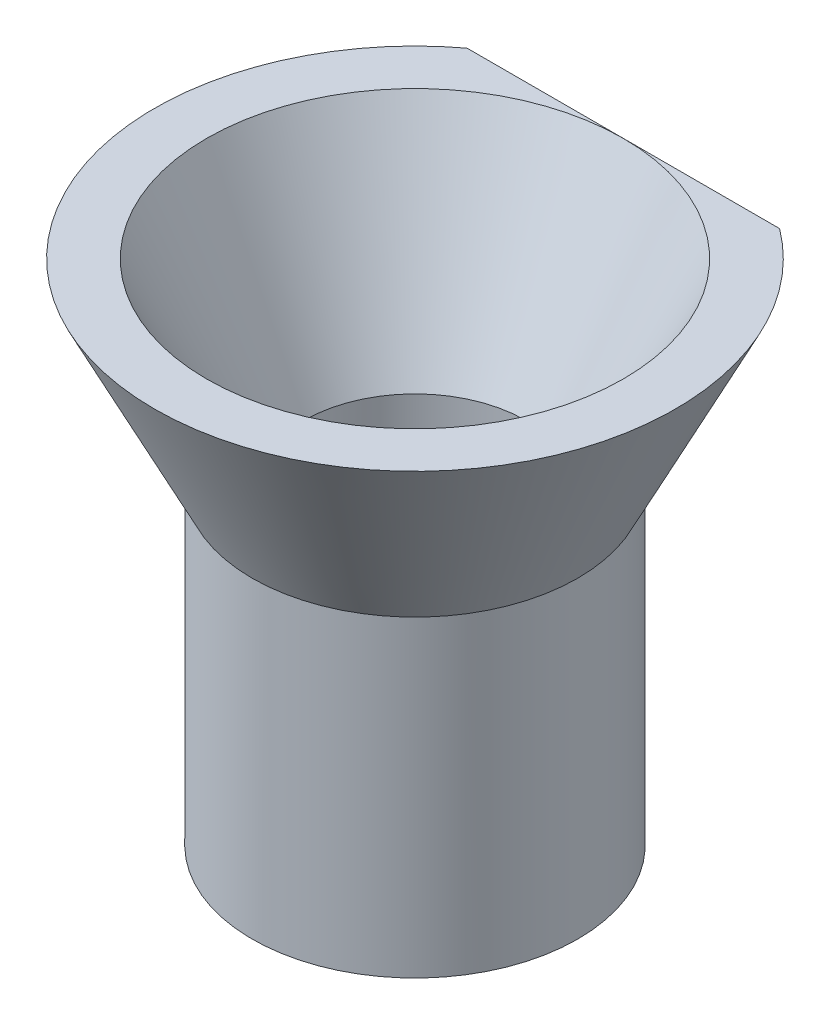
ISO-10303-21;
HEADER;
FILE_DESCRIPTION(('STEP AP214'),'2;1');
FILE_NAME('part.step','',(''),(''),'','','');
FILE_SCHEMA(('AUTOMOTIVE_DESIGN { 1 0 10303 214 1 1 1 1 }'));
ENDSEC;
DATA;
#1=APPLICATION_CONTEXT('core data for automotive mechanical design processes');
#2=APPLICATION_PROTOCOL_DEFINITION('international standard','automotive_design',2000,#1);
#3=PRODUCT_CONTEXT('',#1,'mechanical');
#4=PRODUCT('Part','Part','',(#3));
#5=PRODUCT_RELATED_PRODUCT_CATEGORY('part','',(#4));
#6=PRODUCT_DEFINITION_FORMATION('','',#4);
#7=PRODUCT_DEFINITION_CONTEXT('part definition',#1,'design');
#8=PRODUCT_DEFINITION('design','',#6,#7);
#9=PRODUCT_DEFINITION_SHAPE('','',#8);
#10=(LENGTH_UNIT() NAMED_UNIT(*) SI_UNIT(.MILLI.,.METRE.));
#11=(NAMED_UNIT(*) PLANE_ANGLE_UNIT() SI_UNIT($,.RADIAN.));
#12=(NAMED_UNIT(*) SI_UNIT($,.STERADIAN.) SOLID_ANGLE_UNIT());
#13=UNCERTAINTY_MEASURE_WITH_UNIT(LENGTH_MEASURE(1.E-05),#10,'distance_accuracy_value','');
#14=(GEOMETRIC_REPRESENTATION_CONTEXT(3) GLOBAL_UNCERTAINTY_ASSIGNED_CONTEXT((#13)) GLOBAL_UNIT_ASSIGNED_CONTEXT((#10,
#11,#12)) REPRESENTATION_CONTEXT('',''));
#15=CARTESIAN_POINT('',(0.,0.,0.));
#16=DIRECTION('',(0.,0.,1.));
#17=DIRECTION('',(1.,0.,0.));
#18=AXIS2_PLACEMENT_3D('',#15,#16,#17);
#19=CARTESIAN_POINT('',(0.,7.5,0.));
#20=DIRECTION('',(0.,1.,0.));
#21=DIRECTION('',(-1.,0.,0.));
#22=AXIS2_PLACEMENT_3D('',#19,#20,#21);
#23=CONICAL_SURFACE('',#22,10.,0.463647609000806);
#24=CARTESIAN_POINT('',(-13.16236811645,18.3057094989185,-8.));
#25=CARTESIAN_POINT('',(-12.8866565125175,17.8345786180045,-8.));
#26=CARTESIAN_POINT('',(-12.6092692513679,17.3644183269015,-8.));
#27=CARTESIAN_POINT('',(-12.0502874577452,16.4265244110016,-8.));
#28=CARTESIAN_POINT('',(-11.7686923834115,15.9587911093726,-8.));
#29=CARTESIAN_POINT('',(-11.1989671506079,15.0238270602237,-8.));
#30=CARTESIAN_POINT('',(-10.9108098039585,14.5566128414351,-8.));
#31=CARTESIAN_POINT('',(-10.3283094320585,13.6260981040297,-8.));
#32=CARTESIAN_POINT('',(-10.0339668478739,13.1627973096295,-8.));
#33=CARTESIAN_POINT('',(-9.41650208327037,12.2086447224433,-8.));
#34=CARTESIAN_POINT('',(-9.0928149665079,11.7181564759633,-8.));
#35=CARTESIAN_POINT('',(-8.5986161105696,10.9882051028855,-8.));
#36=CARTESIAN_POINT('',(-8.43241669681943,10.7458209122802,-8.));
#37=CARTESIAN_POINT('',(-8.0966912772788,10.2633699269245,-8.));
#38=CARTESIAN_POINT('',(-7.92716533670764,10.023303086878,-8.));
#39=CARTESIAN_POINT('',(-7.58466981576021,9.54650865629291,-8.));
#40=CARTESIAN_POINT('',(-7.41170949741123,9.30977442365232,-8.));
#41=CARTESIAN_POINT('',(-7.06130857790208,8.83965209425627,-8.));
#42=CARTESIAN_POINT('',(-6.8838681645298,8.60626385789066,-8.));
#43=CARTESIAN_POINT('',(-6.52376608526595,8.14368973141752,-8.));
#44=CARTESIAN_POINT('',(-6.34110651546366,7.91450221329451,-8.));
#45=CARTESIAN_POINT('',(-5.96950652138687,7.46129218577097,-8.));
#46=CARTESIAN_POINT('',(-5.78056683827346,7.23726907212979,-8.));
#47=CARTESIAN_POINT('',(-5.48806718059873,6.90228974311375,-8.));
#48=CARTESIAN_POINT('',(-5.38727856304423,6.78891223227988,-8.));
#49=CARTESIAN_POINT('',(-5.183449698413,6.56419955663216,-8.));
#50=CARTESIAN_POINT('',(-5.08040942062185,6.45286441971605,-8.));
#51=CARTESIAN_POINT('',(-4.7674496099228,6.1222535695849,-8.));
#52=CARTESIAN_POINT('',(-4.55378190962142,5.90647743522737,-8.));
#53=CARTESIAN_POINT('',(-4.11590425067755,5.4893166175092,-8.));
#54=CARTESIAN_POINT('',(-3.89178876181794,5.28783341320102,-8.));
#55=CARTESIAN_POINT('',(-3.42884591132267,4.90260234048284,-8.));
#56=CARTESIAN_POINT('',(-3.19003299823978,4.71883749597307,-8.));
#57=CARTESIAN_POINT('',(-2.82621022540591,4.46769485905769,-8.));
#58=CARTESIAN_POINT('',(-2.7081039696238,4.39032842608795,-8.));
#59=CARTESIAN_POINT('',(-2.46775790902214,4.24236674894749,-8.));
#60=CARTESIAN_POINT('',(-2.3455180756436,4.17177155157236,-8.));
#61=CARTESIAN_POINT('',(-1.97236582771692,3.9721542278641,-8.));
#62=CARTESIAN_POINT('',(-1.71465776989147,3.8550408549057,-8.));
#63=CARTESIAN_POINT('',(-1.33584723944833,3.71999255954502,-8.));
#64=CARTESIAN_POINT('',(-1.22115256812765,3.68369551304586,-8.));
#65=CARTESIAN_POINT('',(-0.989285183257621,3.62023830498513,-8.));
#66=CARTESIAN_POINT('',(-0.872113803554663,3.59307335214619,-8.));
#67=CARTESIAN_POINT('',(-0.635945012694994,3.54875244051935,-8.));
#68=CARTESIAN_POINT('',(-0.516948597277717,3.53159121003646,-8.));
#69=CARTESIAN_POINT('',(-0.27789343320318,3.50787032433859,-8.));
#70=CARTESIAN_POINT('',(-0.157834697534738,3.50131053968106,-8.));
#71=CARTESIAN_POINT('',(0.0827212637538822,3.49904207840001,-8.));
#72=CARTESIAN_POINT('',(0.20321877909943,3.50336368559012,-8.));
#73=CARTESIAN_POINT('',(0.443335755977904,3.52275270505097,-8.));
#74=CARTESIAN_POINT('',(0.562955216413823,3.53782013074482,-8.));
#75=CARTESIAN_POINT('',(0.800463504834371,3.57815163135179,-8.));
#76=CARTESIAN_POINT('',(0.918352172627919,3.60341664399901,-8.));
#77=CARTESIAN_POINT('',(1.15175573961028,3.6633059497335,-8.));
#78=CARTESIAN_POINT('',(1.26726919263066,3.69793577310753,-8.));
#79=CARTESIAN_POINT('',(1.70346237558236,3.84639798462013,-8.));
#80=CARTESIAN_POINT('',(2.01441674692243,3.98956209642398,-8.));
#81=CARTESIAN_POINT('',(2.46152911211326,4.23778393554145,-8.));
#82=CARTESIAN_POINT('',(2.60766256090645,4.32634806617271,-8.));
#83=CARTESIAN_POINT('',(2.8940359320914,4.51260500603934,-8.));
#84=CARTESIAN_POINT('',(3.03427692031736,4.61029615397568,-8.));
#85=CARTESIAN_POINT('',(3.36693283890545,4.85548762450112,-8.));
#86=CARTESIAN_POINT('',(3.55658415091087,5.00670544410447,-8.));
#87=CARTESIAN_POINT('',(3.92657626634716,5.32020723307832,-8.));
#88=CARTESIAN_POINT('',(4.10691212066174,5.48249698062171,-8.));
#89=CARTESIAN_POINT('',(4.45997453925935,5.81579757828255,-8.));
#90=CARTESIAN_POINT('',(4.63268498403952,5.98682539529261,-8.));
#91=CARTESIAN_POINT('',(4.97131369393967,6.33538196701569,-8.));
#92=CARTESIAN_POINT('',(5.13723319985275,6.51290952281002,-8.));
#93=CARTESIAN_POINT('',(5.4654200178678,6.87543518745195,-8.));
#94=CARTESIAN_POINT('',(5.62761364848347,7.06049974011589,-8.));
#95=CARTESIAN_POINT('',(5.94699597670948,7.43489685060718,-8.));
#96=CARTESIAN_POINT('',(6.10418447853586,7.62422957489759,-8.));
#97=CARTESIAN_POINT('',(6.41406135235785,8.00612748218625,-8.));
#98=CARTESIAN_POINT('',(6.56675528775906,8.19868816222914,-8.));
#99=CARTESIAN_POINT('',(6.86842982760865,8.58667765106789,-8.));
#100=CARTESIAN_POINT('',(7.01741058296853,8.7821063427871,-8.));
#101=CARTESIAN_POINT('',(7.34075701926348,9.21354542713446,-8.));
#102=CARTESIAN_POINT('',(7.514436647236,9.45006950480814,-8.));
#103=CARTESIAN_POINT('',(7.85787129928422,9.92595337253976,-8.));
#104=CARTESIAN_POINT('',(8.02762620110868,10.1653132505797,-8.));
#105=CARTESIAN_POINT('',(8.53188497160992,10.8869789332595,-8.));
#106=CARTESIAN_POINT('',(8.86134046947772,11.3728135346948,-8.));
#107=CARTESIAN_POINT('',(9.51020425361046,12.3514578576138,-8.));
#108=CARTESIAN_POINT('',(9.82960735444923,12.8442709948482,-8.));
#109=CARTESIAN_POINT('',(10.4604463174699,13.834981243476,-8.));
#110=CARTESIAN_POINT('',(10.771881937169,14.3328785089563,-8.));
#111=CARTESIAN_POINT('',(11.3892262148216,15.3339199884642,-8.));
#112=CARTESIAN_POINT('',(11.6951178356492,15.8370746839204,-8.));
#113=CARTESIAN_POINT('',(12.3017285054015,16.8464978238173,-8.));
#114=CARTESIAN_POINT('',(12.6024474788831,17.3527663135268,-8.));
#115=CARTESIAN_POINT('',(13.1995307167207,18.3676447127323,-8.));
#116=CARTESIAN_POINT('',(13.4958963371002,18.8762538254144,-8.));
#117=CARTESIAN_POINT('',(14.0850747425916,19.8955256918058,-8.));
#118=CARTESIAN_POINT('',(14.3778875159814,20.4061884522835,-8.));
#119=CARTESIAN_POINT('',(15.1842748976329,21.8220731571916,-8.));
#120=CARTESIAN_POINT('',(15.6946781878989,22.7291010936389,-8.));
#121=CARTESIAN_POINT('',(16.7084791115164,24.5471634158248,-8.));
#122=CARTESIAN_POINT('',(17.2118760962225,25.4581981623741,-8.));
#123=CARTESIAN_POINT('',(18.2107036449723,27.2787725632014,-8.));
#124=CARTESIAN_POINT('',(18.7061612752672,28.1882973786511,-8.));
#125=CARTESIAN_POINT('',(19.4460726995652,29.5542882440425,-8.));
#126=CARTESIAN_POINT('',(19.6921499916747,30.0098763075943,-8.));
#127=CARTESIAN_POINT('',(20.1833274604592,30.9215778180121,-8.));
#128=CARTESIAN_POINT('',(20.4284276389356,31.3776912639075,-8.));
#129=CARTESIAN_POINT('',(20.6730921570559,31.8340383603446,-8.));
#130=B_SPLINE_CURVE_WITH_KNOTS('',3,(#24,#25,#26,#27,#28,#29,#30,#31,#32,#33,#34,#35,#36,#37,
#38,#39,#40,#41,#42,#43,#44,#45,#46,#47,#48,#49,#50,#51,#52,#53,#54,#55,#56,#57,#58,#59,#60,#61,
#62,#63,#64,#65,#66,#67,#68,#69,#70,#71,#72,#73,#74,#75,#76,#77,#78,#79,#80,#81,#82,#83,#84,#85,
#86,#87,#88,#89,#90,#91,#92,#93,#94,#95,#96,#97,#98,#99,#100,#101,#102,#103,#104,#105,#106,#107,
#108,#109,#110,#111,#112,#113,#114,#115,#116,#117,#118,#119,#120,#121,#122,#123,#124,#125,#126,
#127,#128,#129),.UNSPECIFIED.,.F.,.F.,(4,2,2,2,2,2,2,2,2,2,2,2,2,2,2,2,2,2,2,2,2,2,2,2,2,2,2,2,
2,2,2,2,2,2,2,2,2,2,2,2,2,2,2,2,2,2,2,2,2,2,2,2,4),(0.,1.63763889967239,3.27549053531843,
4.92223828492973,6.56886900168641,8.33172526600274,9.21337847250736,10.0950144107115,
10.9745301115113,11.8540090074878,12.7331395235655,13.6121666529945,14.0672380075404,
14.5223155734962,15.4328868929314,16.336405631765,17.2390499160826,17.6624088244199,
18.0857706583537,18.9311632533653,19.291774543307,19.6521963372566,20.0124280264251,
20.3726553171692,20.7338862577532,21.0951176495682,21.4563822665167,21.8178606919894,
22.8380703186421,23.350554485226,23.8629455505447,24.5900571038086,25.3175510655149,
26.0465156900628,26.7753465232004,27.5134832324183,28.251648779702,28.9888585204585,
29.7260382504312,30.6063146830729,31.4866184985935,33.2474398366801,35.0091550651679,
36.7709238461913,38.5374112327663,40.3039243617944,42.0698750455841,43.83583155426,
46.9581074820977,50.0806705736161,53.187811508484,54.7412038905295,56.2945934076884),.UNSPECIFIED.);
#131=CARTESIAN_POINT('',(6.,7.5,-8.));
#132=VERTEX_POINT('',#131);
#133=CARTESIAN_POINT('',(-6.,7.5,-8.));
#134=VERTEX_POINT('',#133);
#135=EDGE_CURVE('E51',#132,#134,#130,.F.);
#136=ORIENTED_EDGE('',*,*,#135,.F.);
#137=CARTESIAN_POINT('',(0.,7.5,0.));
#138=DIRECTION('',(0.,1.,0.));
#139=DIRECTION('',(-1.,0.,0.));
#140=AXIS2_PLACEMENT_3D('',#137,#138,#139);
#141=CIRCLE('',#140,10.);
#142=EDGE_CURVE('E61',#134,#132,#141,.T.);
#143=ORIENTED_EDGE('',*,*,#142,.F.);
#144=EDGE_LOOP('',(#136,#143));
#145=FACE_BOUND('',#144,.T.);
#146=CARTESIAN_POINT('',(0.,0.,0.));
#147=DIRECTION('',(0.,-1.,0.));
#148=DIRECTION('',(1.,0.,0.));
#149=AXIS2_PLACEMENT_3D('',#146,#147,#148);
#150=CIRCLE('',#149,6.25);
#151=CARTESIAN_POINT('',(6.25,0.,0.));
#152=VERTEX_POINT('',#151);
#153=EDGE_CURVE('E70',#152,#152,#150,.T.);
#154=ORIENTED_EDGE('',*,*,#153,.F.);
#155=EDGE_LOOP('',(#154));
#156=FACE_BOUND('',#155,.T.);
#157=ADVANCED_FACE('F33',(#145,#156),#23,.T.);
#158=CARTESIAN_POINT('',(0.,0.,0.));
#159=DIRECTION('',(0.,1.,0.));
#160=DIRECTION('',(-1.,0.,0.));
#161=AXIS2_PLACEMENT_3D('',#158,#159,#160);
#162=CONICAL_SURFACE('',#161,4.25,0.463647609000806);
#163=CARTESIAN_POINT('',(0.,7.5,0.));
#164=DIRECTION('',(0.,1.,0.));
#165=DIRECTION('',(-1.,0.,0.));
#166=AXIS2_PLACEMENT_3D('',#163,#164,#165);
#167=CIRCLE('',#166,8.);
#168=CARTESIAN_POINT('',(0.,7.5,-8.));
#169=VERTEX_POINT('',#168);
#170=EDGE_CURVE('E63',#169,#169,#167,.T.);
#171=ORIENTED_EDGE('',*,*,#170,.T.);
#172=EDGE_LOOP('',(#171));
#173=FACE_BOUND('',#172,.T.);
#174=CARTESIAN_POINT('',(0.,0.,0.));
#175=DIRECTION('',(0.,1.,0.));
#176=DIRECTION('',(-1.,0.,0.));
#177=AXIS2_PLACEMENT_3D('',#174,#175,#176);
#178=CIRCLE('',#177,4.25);
#179=CARTESIAN_POINT('',(-4.25,0.,0.));
#180=VERTEX_POINT('',#179);
#181=EDGE_CURVE('E67',#180,#180,#178,.T.);
#182=ORIENTED_EDGE('',*,*,#181,.F.);
#183=EDGE_LOOP('',(#182));
#184=FACE_BOUND('',#183,.T.);
#185=ADVANCED_FACE('F78',(#173,#184),#162,.F.);
#186=CARTESIAN_POINT('',(-8.,7.5,0.));
#187=DIRECTION('',(0.,1.,0.));
#188=DIRECTION('',(-1.,0.,0.));
#189=AXIS2_PLACEMENT_3D('',#186,#187,#188);
#190=PLANE('',#189);
#191=DIRECTION('',(1.,0.,0.));
#192=VECTOR('',#191,1.);
#193=CARTESIAN_POINT('',(-8.,7.5,-8.));
#194=LINE('',#193,#192);
#195=EDGE_CURVE('E11',#134,#169,#194,.T.);
#196=ORIENTED_EDGE('',*,*,#195,.F.);
#197=ORIENTED_EDGE('',*,*,#142,.T.);
#198=EDGE_CURVE('E37',#169,#132,#194,.T.);
#199=ORIENTED_EDGE('',*,*,#198,.F.);
#200=ORIENTED_EDGE('',*,*,#170,.F.);
#201=EDGE_LOOP('',(#196,#197,#199,#200));
#202=FACE_BOUND('',#201,.T.);
#203=ADVANCED_FACE('F60',(#202),#190,.T.);
#204=CARTESIAN_POINT('',(0.,-12.,0.));
#205=DIRECTION('',(0.,-1.,0.));
#206=DIRECTION('',(1.,0.,0.));
#207=AXIS2_PLACEMENT_3D('',#204,#205,#206);
#208=PLANE('',#207);
#209=CARTESIAN_POINT('',(0.,-12.,0.));
#210=DIRECTION('',(0.,-1.,0.));
#211=DIRECTION('',(1.,0.,0.));
#212=AXIS2_PLACEMENT_3D('',#209,#210,#211);
#213=CIRCLE('',#212,6.25);
#214=CARTESIAN_POINT('',(6.25,-12.,0.));
#215=VERTEX_POINT('',#214);
#216=EDGE_CURVE('E65',#215,#215,#213,.T.);
#217=ORIENTED_EDGE('',*,*,#216,.T.);
#218=EDGE_LOOP('',(#217));
#219=FACE_BOUND('',#218,.T.);
#220=CARTESIAN_POINT('',(0.,-12.,0.));
#221=DIRECTION('',(0.,-1.,0.));
#222=DIRECTION('',(1.,0.,0.));
#223=AXIS2_PLACEMENT_3D('',#220,#221,#222);
#224=CIRCLE('',#223,4.25);
#225=CARTESIAN_POINT('',(4.25,-12.,0.));
#226=VERTEX_POINT('',#225);
#227=EDGE_CURVE('E56',#226,#226,#224,.T.);
#228=ORIENTED_EDGE('',*,*,#227,.F.);
#229=EDGE_LOOP('',(#228));
#230=FACE_BOUND('',#229,.T.);
#231=ADVANCED_FACE('F85',(#219,#230),#208,.T.);
#232=CARTESIAN_POINT('',(0.,-12.,0.));
#233=DIRECTION('',(0.,1.,0.));
#234=DIRECTION('',(-1.,0.,0.));
#235=AXIS2_PLACEMENT_3D('',#232,#233,#234);
#236=CYLINDRICAL_SURFACE('',#235,6.25);
#237=ORIENTED_EDGE('',*,*,#216,.F.);
#238=EDGE_LOOP('',(#237));
#239=FACE_BOUND('',#238,.T.);
#240=ORIENTED_EDGE('',*,*,#153,.T.);
#241=EDGE_LOOP('',(#240));
#242=FACE_BOUND('',#241,.T.);
#243=ADVANCED_FACE('F88',(#239,#242),#236,.T.);
#244=CARTESIAN_POINT('',(0.,-12.,0.));
#245=DIRECTION('',(0.,1.,0.));
#246=DIRECTION('',(-1.,0.,0.));
#247=AXIS2_PLACEMENT_3D('',#244,#245,#246);
#248=CYLINDRICAL_SURFACE('',#247,4.25);
#249=ORIENTED_EDGE('',*,*,#227,.T.);
#250=EDGE_LOOP('',(#249));
#251=FACE_BOUND('',#250,.T.);
#252=ORIENTED_EDGE('',*,*,#181,.T.);
#253=EDGE_LOOP('',(#252));
#254=FACE_BOUND('',#253,.T.);
#255=ADVANCED_FACE('F76',(#251,#254),#248,.F.);
#256=CARTESIAN_POINT('',(-10.9770614438928,-2.5,-8.));
#257=DIRECTION('',(0.,0.,1.));
#258=DIRECTION('',(1.,0.,0.));
#259=AXIS2_PLACEMENT_3D('',#256,#257,#258);
#260=PLANE('',#259);
#261=ORIENTED_EDGE('',*,*,#135,.T.);
#262=ORIENTED_EDGE('',*,*,#195,.T.);
#263=ORIENTED_EDGE('',*,*,#198,.T.);
#264=EDGE_LOOP('',(#261,#262,#263));
#265=FACE_BOUND('',#264,.T.);
#266=ADVANCED_FACE('F52',(#265),#260,.F.);
#267=CLOSED_SHELL('',(#157,#185,#203,#231,#243,#255,#266));
#268=MANIFOLD_SOLID_BREP('B2',#267);
#269=ADVANCED_BREP_SHAPE_REPRESENTATION('',(#18,#268),#14);
#270=SHAPE_DEFINITION_REPRESENTATION(#9,#269);
ENDSEC;
END-ISO-10303-21;
